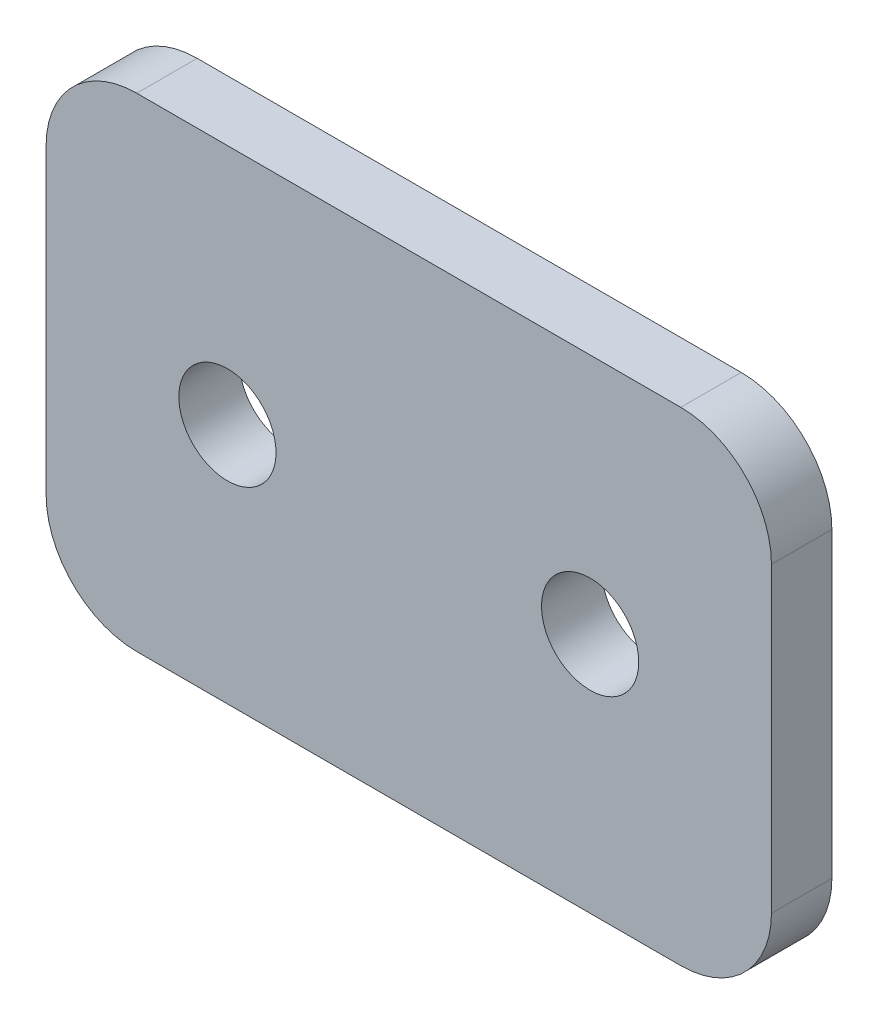
ISO-10303-21;
HEADER;
FILE_DESCRIPTION(('STEP AP214'),'2;1');
FILE_NAME('part.step','',(''),(''),'','','');
FILE_SCHEMA(('AUTOMOTIVE_DESIGN { 1 0 10303 214 1 1 1 1 }'));
ENDSEC;
DATA;
#1=APPLICATION_CONTEXT('core data for automotive mechanical design processes');
#2=APPLICATION_PROTOCOL_DEFINITION('international standard','automotive_design',2000,#1);
#3=PRODUCT_CONTEXT('',#1,'mechanical');
#4=PRODUCT('Part','Part','',(#3));
#5=PRODUCT_RELATED_PRODUCT_CATEGORY('part','',(#4));
#6=PRODUCT_DEFINITION_FORMATION('','',#4);
#7=PRODUCT_DEFINITION_CONTEXT('part definition',#1,'design');
#8=PRODUCT_DEFINITION('design','',#6,#7);
#9=PRODUCT_DEFINITION_SHAPE('','',#8);
#10=(LENGTH_UNIT() NAMED_UNIT(*) SI_UNIT(.MILLI.,.METRE.));
#11=(NAMED_UNIT(*) PLANE_ANGLE_UNIT() SI_UNIT($,.RADIAN.));
#12=(NAMED_UNIT(*) SI_UNIT($,.STERADIAN.) SOLID_ANGLE_UNIT());
#13=UNCERTAINTY_MEASURE_WITH_UNIT(LENGTH_MEASURE(1.E-05),#10,'distance_accuracy_value','');
#14=(GEOMETRIC_REPRESENTATION_CONTEXT(3) GLOBAL_UNCERTAINTY_ASSIGNED_CONTEXT((#13)) GLOBAL_UNIT_ASSIGNED_CONTEXT((#10,
#11,#12)) REPRESENTATION_CONTEXT('',''));
#15=CARTESIAN_POINT('',(0.,0.,0.));
#16=DIRECTION('',(0.,0.,1.));
#17=DIRECTION('',(1.,0.,0.));
#18=AXIS2_PLACEMENT_3D('',#15,#16,#17);
#19=CARTESIAN_POINT('',(0.,0.,3.175));
#20=DIRECTION('',(0.,0.,-1.));
#21=DIRECTION('',(-1.,0.,0.));
#22=AXIS2_PLACEMENT_3D('',#19,#20,#21);
#23=PLANE('',#22);
#24=DIRECTION('',(-1.,0.,0.));
#25=VECTOR('',#24,1.);
#26=CARTESIAN_POINT('',(0.,25.4,3.175));
#27=LINE('',#26,#25);
#28=CARTESIAN_POINT('',(33.3375,25.4,3.175));
#29=VERTEX_POINT('',#28);
#30=CARTESIAN_POINT('',(4.7625,25.4,3.175));
#31=VERTEX_POINT('',#30);
#32=EDGE_CURVE('E148',#29,#31,#27,.T.);
#33=ORIENTED_EDGE('',*,*,#32,.T.);
#34=CARTESIAN_POINT('',(4.7625,20.6375,3.175));
#35=DIRECTION('',(0.,0.,-1.));
#36=DIRECTION('',(-1.,0.,0.));
#37=AXIS2_PLACEMENT_3D('',#34,#35,#36);
#38=CIRCLE('',#37,4.7625);
#39=CARTESIAN_POINT('',(0.,20.6375,3.175));
#40=VERTEX_POINT('',#39);
#41=EDGE_CURVE('E178',#31,#40,#38,.F.);
#42=ORIENTED_EDGE('',*,*,#41,.T.);
#43=DIRECTION('',(0.,-1.,0.));
#44=VECTOR('',#43,1.);
#45=CARTESIAN_POINT('',(0.,0.,3.175));
#46=LINE('',#45,#44);
#47=CARTESIAN_POINT('',(0.,4.7625,3.175));
#48=VERTEX_POINT('',#47);
#49=EDGE_CURVE('E127',#40,#48,#46,.T.);
#50=ORIENTED_EDGE('',*,*,#49,.T.);
#51=CARTESIAN_POINT('',(4.7625,4.7625,3.175));
#52=DIRECTION('',(0.,0.,-1.));
#53=DIRECTION('',(-1.,0.,0.));
#54=AXIS2_PLACEMENT_3D('',#51,#52,#53);
#55=CIRCLE('',#54,4.7625);
#56=CARTESIAN_POINT('',(4.7625,0.,3.175));
#57=VERTEX_POINT('',#56);
#58=EDGE_CURVE('E175',#48,#57,#55,.F.);
#59=ORIENTED_EDGE('',*,*,#58,.T.);
#60=DIRECTION('',(1.,0.,0.));
#61=VECTOR('',#60,1.);
#62=CARTESIAN_POINT('',(0.,0.,3.175));
#63=LINE('',#62,#61);
#64=CARTESIAN_POINT('',(33.3375,0.,3.175));
#65=VERTEX_POINT('',#64);
#66=EDGE_CURVE('E193',#57,#65,#63,.T.);
#67=ORIENTED_EDGE('',*,*,#66,.T.);
#68=CARTESIAN_POINT('',(33.3375,4.7625,3.175));
#69=DIRECTION('',(0.,0.,-1.));
#70=DIRECTION('',(-1.,0.,0.));
#71=AXIS2_PLACEMENT_3D('',#68,#69,#70);
#72=CIRCLE('',#71,4.7625);
#73=CARTESIAN_POINT('',(38.1,4.7625,3.175));
#74=VERTEX_POINT('',#73);
#75=EDGE_CURVE('E61',#65,#74,#72,.F.);
#76=ORIENTED_EDGE('',*,*,#75,.T.);
#77=DIRECTION('',(0.,1.,0.));
#78=VECTOR('',#77,1.);
#79=CARTESIAN_POINT('',(38.1,0.,3.175));
#80=LINE('',#79,#78);
#81=CARTESIAN_POINT('',(38.1,20.6375,3.175));
#82=VERTEX_POINT('',#81);
#83=EDGE_CURVE('E191',#74,#82,#80,.T.);
#84=ORIENTED_EDGE('',*,*,#83,.T.);
#85=CARTESIAN_POINT('',(33.3375,20.6375,3.175));
#86=DIRECTION('',(0.,0.,-1.));
#87=DIRECTION('',(-1.,0.,0.));
#88=AXIS2_PLACEMENT_3D('',#85,#86,#87);
#89=CIRCLE('',#88,4.7625);
#90=EDGE_CURVE('E170',#82,#29,#89,.F.);
#91=ORIENTED_EDGE('',*,*,#90,.T.);
#92=EDGE_LOOP('',(#33,#42,#50,#59,#67,#76,#84,#91));
#93=FACE_BOUND('',#92,.T.);
#94=CARTESIAN_POINT('',(9.525,12.7,3.175));
#95=DIRECTION('',(0.,0.,1.));
#96=DIRECTION('',(1.,0.,0.));
#97=AXIS2_PLACEMENT_3D('',#94,#95,#96);
#98=CIRCLE('',#97,2.5527);
#99=CARTESIAN_POINT('',(12.0777,12.7,3.175));
#100=VERTEX_POINT('',#99);
#101=EDGE_CURVE('E137',#100,#100,#98,.T.);
#102=ORIENTED_EDGE('',*,*,#101,.F.);
#103=EDGE_LOOP('',(#102));
#104=FACE_BOUND('',#103,.T.);
#105=CARTESIAN_POINT('',(28.575,12.7,3.175));
#106=DIRECTION('',(0.,0.,1.));
#107=DIRECTION('',(1.,0.,0.));
#108=AXIS2_PLACEMENT_3D('',#105,#106,#107);
#109=CIRCLE('',#108,2.5527);
#110=CARTESIAN_POINT('',(31.1277,12.7,3.175));
#111=VERTEX_POINT('',#110);
#112=EDGE_CURVE('E201',#111,#111,#109,.T.);
#113=ORIENTED_EDGE('',*,*,#112,.F.);
#114=EDGE_LOOP('',(#113));
#115=FACE_BOUND('',#114,.T.);
#116=ADVANCED_FACE('F39',(#93,#104,#115),#23,.F.);
#117=CARTESIAN_POINT('',(0.,0.,0.));
#118=DIRECTION('',(0.,0.,-1.));
#119=DIRECTION('',(-1.,0.,0.));
#120=AXIS2_PLACEMENT_3D('',#117,#118,#119);
#121=PLANE('',#120);
#122=CARTESIAN_POINT('',(9.525,12.7,0.));
#123=DIRECTION('',(0.,0.,1.));
#124=DIRECTION('',(1.,0.,0.));
#125=AXIS2_PLACEMENT_3D('',#122,#123,#124);
#126=CIRCLE('',#125,2.5527);
#127=CARTESIAN_POINT('',(12.0777,12.7,0.));
#128=VERTEX_POINT('',#127);
#129=EDGE_CURVE('E145',#128,#128,#126,.T.);
#130=ORIENTED_EDGE('',*,*,#129,.T.);
#131=EDGE_LOOP('',(#130));
#132=FACE_BOUND('',#131,.T.);
#133=DIRECTION('',(0.,-1.,0.));
#134=VECTOR('',#133,1.);
#135=CARTESIAN_POINT('',(0.,0.,0.));
#136=LINE('',#135,#134);
#137=CARTESIAN_POINT('',(0.,20.6375,0.));
#138=VERTEX_POINT('',#137);
#139=CARTESIAN_POINT('',(0.,4.7625,0.));
#140=VERTEX_POINT('',#139);
#141=EDGE_CURVE('E124',#138,#140,#136,.T.);
#142=ORIENTED_EDGE('',*,*,#141,.F.);
#143=CARTESIAN_POINT('',(4.7625,20.6375,0.));
#144=DIRECTION('',(0.,0.,-1.));
#145=DIRECTION('',(-1.,0.,0.));
#146=AXIS2_PLACEMENT_3D('',#143,#144,#145);
#147=CIRCLE('',#146,4.7625);
#148=CARTESIAN_POINT('',(4.7625,25.4,0.));
#149=VERTEX_POINT('',#148);
#150=EDGE_CURVE('E106',#138,#149,#147,.T.);
#151=ORIENTED_EDGE('',*,*,#150,.T.);
#152=DIRECTION('',(-1.,0.,0.));
#153=VECTOR('',#152,1.);
#154=CARTESIAN_POINT('',(0.,25.4,0.));
#155=LINE('',#154,#153);
#156=CARTESIAN_POINT('',(33.3375,25.4,0.));
#157=VERTEX_POINT('',#156);
#158=EDGE_CURVE('E153',#157,#149,#155,.T.);
#159=ORIENTED_EDGE('',*,*,#158,.F.);
#160=CARTESIAN_POINT('',(33.3375,20.6375,0.));
#161=DIRECTION('',(0.,0.,-1.));
#162=DIRECTION('',(-1.,0.,0.));
#163=AXIS2_PLACEMENT_3D('',#160,#161,#162);
#164=CIRCLE('',#163,4.7625);
#165=CARTESIAN_POINT('',(38.1,20.6375,0.));
#166=VERTEX_POINT('',#165);
#167=EDGE_CURVE('E129',#157,#166,#164,.T.);
#168=ORIENTED_EDGE('',*,*,#167,.T.);
#169=DIRECTION('',(0.,1.,0.));
#170=VECTOR('',#169,1.);
#171=CARTESIAN_POINT('',(38.1,0.,0.));
#172=LINE('',#171,#170);
#173=CARTESIAN_POINT('',(38.1,4.7625,0.));
#174=VERTEX_POINT('',#173);
#175=EDGE_CURVE('E142',#174,#166,#172,.T.);
#176=ORIENTED_EDGE('',*,*,#175,.F.);
#177=CARTESIAN_POINT('',(33.3375,4.7625,0.));
#178=DIRECTION('',(0.,0.,-1.));
#179=DIRECTION('',(-1.,0.,0.));
#180=AXIS2_PLACEMENT_3D('',#177,#178,#179);
#181=CIRCLE('',#180,4.7625);
#182=CARTESIAN_POINT('',(33.3375,0.,0.));
#183=VERTEX_POINT('',#182);
#184=EDGE_CURVE('E160',#174,#183,#181,.T.);
#185=ORIENTED_EDGE('',*,*,#184,.T.);
#186=DIRECTION('',(1.,0.,0.));
#187=VECTOR('',#186,1.);
#188=CARTESIAN_POINT('',(0.,0.,0.));
#189=LINE('',#188,#187);
#190=CARTESIAN_POINT('',(4.7625,0.,0.));
#191=VERTEX_POINT('',#190);
#192=EDGE_CURVE('E136',#191,#183,#189,.T.);
#193=ORIENTED_EDGE('',*,*,#192,.F.);
#194=CARTESIAN_POINT('',(4.7625,4.7625,0.));
#195=DIRECTION('',(0.,0.,-1.));
#196=DIRECTION('',(-1.,0.,0.));
#197=AXIS2_PLACEMENT_3D('',#194,#195,#196);
#198=CIRCLE('',#197,4.7625);
#199=EDGE_CURVE('E118',#191,#140,#198,.T.);
#200=ORIENTED_EDGE('',*,*,#199,.T.);
#201=EDGE_LOOP('',(#142,#151,#159,#168,#176,#185,#193,#200));
#202=FACE_BOUND('',#201,.T.);
#203=CARTESIAN_POINT('',(28.575,12.7,0.));
#204=DIRECTION('',(0.,0.,1.));
#205=DIRECTION('',(1.,0.,0.));
#206=AXIS2_PLACEMENT_3D('',#203,#204,#205);
#207=CIRCLE('',#206,2.5527);
#208=CARTESIAN_POINT('',(31.1277,12.7,0.));
#209=VERTEX_POINT('',#208);
#210=EDGE_CURVE('E203',#209,#209,#207,.T.);
#211=ORIENTED_EDGE('',*,*,#210,.T.);
#212=EDGE_LOOP('',(#211));
#213=FACE_BOUND('',#212,.T.);
#214=ADVANCED_FACE('F132',(#132,#202,#213),#121,.T.);
#215=CARTESIAN_POINT('',(0.,0.,3.175));
#216=DIRECTION('',(1.,0.,0.));
#217=DIRECTION('',(0.,0.,-1.));
#218=AXIS2_PLACEMENT_3D('',#215,#216,#217);
#219=PLANE('',#218);
#220=ORIENTED_EDGE('',*,*,#49,.F.);
#221=DIRECTION('',(0.,0.,-1.));
#222=VECTOR('',#221,1.);
#223=CARTESIAN_POINT('',(0.,20.6375,3.175));
#224=LINE('',#223,#222);
#225=EDGE_CURVE('E110',#40,#138,#224,.T.);
#226=ORIENTED_EDGE('',*,*,#225,.T.);
#227=ORIENTED_EDGE('',*,*,#141,.T.);
#228=DIRECTION('',(0.,0.,-1.));
#229=VECTOR('',#228,1.);
#230=CARTESIAN_POINT('',(0.,4.7625,3.175));
#231=LINE('',#230,#229);
#232=EDGE_CURVE('E130',#140,#48,#231,.F.);
#233=ORIENTED_EDGE('',*,*,#232,.T.);
#234=EDGE_LOOP('',(#220,#226,#227,#233));
#235=FACE_BOUND('',#234,.T.);
#236=ADVANCED_FACE('F123',(#235),#219,.F.);
#237=CARTESIAN_POINT('',(0.,0.,3.175));
#238=DIRECTION('',(0.,1.,0.));
#239=DIRECTION('',(0.,0.,1.));
#240=AXIS2_PLACEMENT_3D('',#237,#238,#239);
#241=PLANE('',#240);
#242=ORIENTED_EDGE('',*,*,#66,.F.);
#243=DIRECTION('',(0.,0.,-1.));
#244=VECTOR('',#243,1.);
#245=CARTESIAN_POINT('',(4.7625,0.,3.175));
#246=LINE('',#245,#244);
#247=EDGE_CURVE('E184',#57,#191,#246,.T.);
#248=ORIENTED_EDGE('',*,*,#247,.T.);
#249=ORIENTED_EDGE('',*,*,#192,.T.);
#250=DIRECTION('',(0.,0.,-1.));
#251=VECTOR('',#250,1.);
#252=CARTESIAN_POINT('',(33.3375,0.,3.175));
#253=LINE('',#252,#251);
#254=EDGE_CURVE('E181',#183,#65,#253,.F.);
#255=ORIENTED_EDGE('',*,*,#254,.T.);
#256=EDGE_LOOP('',(#242,#248,#249,#255));
#257=FACE_BOUND('',#256,.T.);
#258=ADVANCED_FACE('F233',(#257),#241,.F.);
#259=CARTESIAN_POINT('',(38.1,0.,3.175));
#260=DIRECTION('',(-1.,0.,0.));
#261=DIRECTION('',(0.,0.,1.));
#262=AXIS2_PLACEMENT_3D('',#259,#260,#261);
#263=PLANE('',#262);
#264=ORIENTED_EDGE('',*,*,#83,.F.);
#265=DIRECTION('',(0.,0.,-1.));
#266=VECTOR('',#265,1.);
#267=CARTESIAN_POINT('',(38.1,4.7625,3.175));
#268=LINE('',#267,#266);
#269=EDGE_CURVE('E11',#74,#174,#268,.T.);
#270=ORIENTED_EDGE('',*,*,#269,.T.);
#271=ORIENTED_EDGE('',*,*,#175,.T.);
#272=DIRECTION('',(0.,0.,-1.));
#273=VECTOR('',#272,1.);
#274=CARTESIAN_POINT('',(38.1,20.6375,3.175));
#275=LINE('',#274,#273);
#276=EDGE_CURVE('E48',#166,#82,#275,.F.);
#277=ORIENTED_EDGE('',*,*,#276,.T.);
#278=EDGE_LOOP('',(#264,#270,#271,#277));
#279=FACE_BOUND('',#278,.T.);
#280=ADVANCED_FACE('F229',(#279),#263,.F.);
#281=CARTESIAN_POINT('',(0.,25.4,3.175));
#282=DIRECTION('',(0.,-1.,0.));
#283=DIRECTION('',(0.,0.,-1.));
#284=AXIS2_PLACEMENT_3D('',#281,#282,#283);
#285=PLANE('',#284);
#286=ORIENTED_EDGE('',*,*,#158,.T.);
#287=DIRECTION('',(0.,0.,-1.));
#288=VECTOR('',#287,1.);
#289=CARTESIAN_POINT('',(4.7625,25.4,3.175));
#290=LINE('',#289,#288);
#291=EDGE_CURVE('E111',#149,#31,#290,.F.);
#292=ORIENTED_EDGE('',*,*,#291,.T.);
#293=ORIENTED_EDGE('',*,*,#32,.F.);
#294=DIRECTION('',(0.,0.,-1.));
#295=VECTOR('',#294,1.);
#296=CARTESIAN_POINT('',(33.3375,25.4,3.175));
#297=LINE('',#296,#295);
#298=EDGE_CURVE('E117',#29,#157,#297,.T.);
#299=ORIENTED_EDGE('',*,*,#298,.T.);
#300=EDGE_LOOP('',(#286,#292,#293,#299));
#301=FACE_BOUND('',#300,.T.);
#302=ADVANCED_FACE('F226',(#301),#285,.F.);
#303=CARTESIAN_POINT('',(9.525,12.7,3.175));
#304=DIRECTION('',(0.,0.,-1.));
#305=DIRECTION('',(-1.,0.,0.));
#306=AXIS2_PLACEMENT_3D('',#303,#304,#305);
#307=CYLINDRICAL_SURFACE('',#306,2.5527);
#308=ORIENTED_EDGE('',*,*,#101,.T.);
#309=EDGE_LOOP('',(#308));
#310=FACE_BOUND('',#309,.T.);
#311=ORIENTED_EDGE('',*,*,#129,.F.);
#312=EDGE_LOOP('',(#311));
#313=FACE_BOUND('',#312,.T.);
#314=ADVANCED_FACE('F223',(#310,#313),#307,.F.);
#315=CARTESIAN_POINT('',(28.575,12.7,3.175));
#316=DIRECTION('',(0.,0.,-1.));
#317=DIRECTION('',(-1.,0.,0.));
#318=AXIS2_PLACEMENT_3D('',#315,#316,#317);
#319=CYLINDRICAL_SURFACE('',#318,2.5527);
#320=ORIENTED_EDGE('',*,*,#112,.T.);
#321=EDGE_LOOP('',(#320));
#322=FACE_BOUND('',#321,.T.);
#323=ORIENTED_EDGE('',*,*,#210,.F.);
#324=EDGE_LOOP('',(#323));
#325=FACE_BOUND('',#324,.T.);
#326=ADVANCED_FACE('F211',(#322,#325),#319,.F.);
#327=CARTESIAN_POINT('',(4.7625,20.6375,3.175));
#328=DIRECTION('',(0.,0.,-1.));
#329=DIRECTION('',(-1.,0.,0.));
#330=AXIS2_PLACEMENT_3D('',#327,#328,#329);
#331=CYLINDRICAL_SURFACE('',#330,4.7625);
#332=ORIENTED_EDGE('',*,*,#41,.F.);
#333=ORIENTED_EDGE('',*,*,#291,.F.);
#334=ORIENTED_EDGE('',*,*,#150,.F.);
#335=ORIENTED_EDGE('',*,*,#225,.F.);
#336=EDGE_LOOP('',(#332,#333,#334,#335));
#337=FACE_BOUND('',#336,.T.);
#338=ADVANCED_FACE('F109',(#337),#331,.T.);
#339=CARTESIAN_POINT('',(4.7625,4.7625,3.175));
#340=DIRECTION('',(0.,0.,-1.));
#341=DIRECTION('',(-1.,0.,0.));
#342=AXIS2_PLACEMENT_3D('',#339,#340,#341);
#343=CYLINDRICAL_SURFACE('',#342,4.7625);
#344=ORIENTED_EDGE('',*,*,#58,.F.);
#345=ORIENTED_EDGE('',*,*,#232,.F.);
#346=ORIENTED_EDGE('',*,*,#199,.F.);
#347=ORIENTED_EDGE('',*,*,#247,.F.);
#348=EDGE_LOOP('',(#344,#345,#346,#347));
#349=FACE_BOUND('',#348,.T.);
#350=ADVANCED_FACE('F241',(#349),#343,.T.);
#351=CARTESIAN_POINT('',(33.3375,4.7625,3.175));
#352=DIRECTION('',(0.,0.,-1.));
#353=DIRECTION('',(-1.,0.,0.));
#354=AXIS2_PLACEMENT_3D('',#351,#352,#353);
#355=CYLINDRICAL_SURFACE('',#354,4.7625);
#356=ORIENTED_EDGE('',*,*,#75,.F.);
#357=ORIENTED_EDGE('',*,*,#254,.F.);
#358=ORIENTED_EDGE('',*,*,#184,.F.);
#359=ORIENTED_EDGE('',*,*,#269,.F.);
#360=EDGE_LOOP('',(#356,#357,#358,#359));
#361=FACE_BOUND('',#360,.T.);
#362=ADVANCED_FACE('F243',(#361),#355,.T.);
#363=CARTESIAN_POINT('',(33.3375,20.6375,3.175));
#364=DIRECTION('',(0.,0.,-1.));
#365=DIRECTION('',(-1.,0.,0.));
#366=AXIS2_PLACEMENT_3D('',#363,#364,#365);
#367=CYLINDRICAL_SURFACE('',#366,4.7625);
#368=ORIENTED_EDGE('',*,*,#90,.F.);
#369=ORIENTED_EDGE('',*,*,#276,.F.);
#370=ORIENTED_EDGE('',*,*,#167,.F.);
#371=ORIENTED_EDGE('',*,*,#298,.F.);
#372=EDGE_LOOP('',(#368,#369,#370,#371));
#373=FACE_BOUND('',#372,.T.);
#374=ADVANCED_FACE('F41',(#373),#367,.T.);
#375=CLOSED_SHELL('',(#116,#214,#236,#258,#280,#302,#314,#326,#338,#350,#362,#374));
#376=MANIFOLD_SOLID_BREP('B2',#375);
#377=ADVANCED_BREP_SHAPE_REPRESENTATION('',(#18,#376),#14);
#378=SHAPE_DEFINITION_REPRESENTATION(#9,#377);
ENDSEC;
END-ISO-10303-21;
